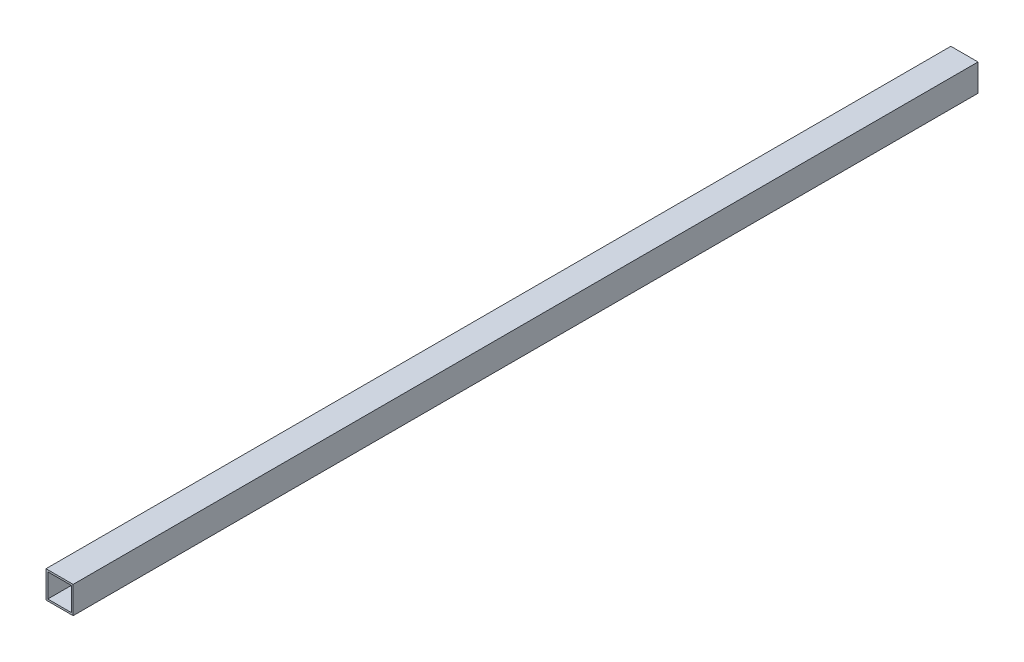
ISO-10303-21;
HEADER;
FILE_DESCRIPTION(('STEP AP214'),'2;1');
FILE_NAME('part.step','',(''),(''),'','','');
FILE_SCHEMA(('AUTOMOTIVE_DESIGN { 1 0 10303 214 1 1 1 1 }'));
ENDSEC;
DATA;
#1=APPLICATION_CONTEXT('core data for automotive mechanical design processes');
#2=APPLICATION_PROTOCOL_DEFINITION('international standard','automotive_design',2000,#1);
#3=PRODUCT_CONTEXT('',#1,'mechanical');
#4=PRODUCT('Part','Part','',(#3));
#5=PRODUCT_RELATED_PRODUCT_CATEGORY('part','',(#4));
#6=PRODUCT_DEFINITION_FORMATION('','',#4);
#7=PRODUCT_DEFINITION_CONTEXT('part definition',#1,'design');
#8=PRODUCT_DEFINITION('design','',#6,#7);
#9=PRODUCT_DEFINITION_SHAPE('','',#8);
#10=(LENGTH_UNIT() NAMED_UNIT(*) SI_UNIT(.MILLI.,.METRE.));
#11=(NAMED_UNIT(*) PLANE_ANGLE_UNIT() SI_UNIT($,.RADIAN.));
#12=(NAMED_UNIT(*) SI_UNIT($,.STERADIAN.) SOLID_ANGLE_UNIT());
#13=UNCERTAINTY_MEASURE_WITH_UNIT(LENGTH_MEASURE(1.E-05),#10,'distance_accuracy_value','');
#14=(GEOMETRIC_REPRESENTATION_CONTEXT(3) GLOBAL_UNCERTAINTY_ASSIGNED_CONTEXT((#13)) GLOBAL_UNIT_ASSIGNED_CONTEXT((#10,
#11,#12)) REPRESENTATION_CONTEXT('',''));
#15=CARTESIAN_POINT('',(0.,0.,0.));
#16=DIRECTION('',(0.,0.,1.));
#17=DIRECTION('',(1.,0.,0.));
#18=AXIS2_PLACEMENT_3D('',#15,#16,#17);
#19=CARTESIAN_POINT('',(-30.,30.,0.));
#20=DIRECTION('',(-1.,0.,0.));
#21=DIRECTION('',(0.,0.,1.));
#22=AXIS2_PLACEMENT_3D('',#19,#20,#21);
#23=PLANE('',#22);
#24=DIRECTION('',(0.,0.,1.));
#25=VECTOR('',#24,1.);
#26=CARTESIAN_POINT('',(-30.,-30.,0.));
#27=LINE('',#26,#25);
#28=CARTESIAN_POINT('',(-30.,-30.,0.));
#29=VERTEX_POINT('',#28);
#30=CARTESIAN_POINT('',(-30.,-30.,2000.));
#31=VERTEX_POINT('',#30);
#32=EDGE_CURVE('E90',#29,#31,#27,.T.);
#33=ORIENTED_EDGE('',*,*,#32,.T.);
#34=DIRECTION('',(0.,-1.,0.));
#35=VECTOR('',#34,1.);
#36=CARTESIAN_POINT('',(-30.,30.,2000.));
#37=LINE('',#36,#35);
#38=CARTESIAN_POINT('',(-30.,30.,2000.));
#39=VERTEX_POINT('',#38);
#40=EDGE_CURVE('E112',#39,#31,#37,.T.);
#41=ORIENTED_EDGE('',*,*,#40,.F.);
#42=DIRECTION('',(0.,0.,1.));
#43=VECTOR('',#42,1.);
#44=CARTESIAN_POINT('',(-30.,30.,0.));
#45=LINE('',#44,#43);
#46=CARTESIAN_POINT('',(-30.,30.,0.));
#47=VERTEX_POINT('',#46);
#48=EDGE_CURVE('E93',#47,#39,#45,.T.);
#49=ORIENTED_EDGE('',*,*,#48,.F.);
#50=DIRECTION('',(0.,-1.,0.));
#51=VECTOR('',#50,1.);
#52=CARTESIAN_POINT('',(-30.,30.,0.));
#53=LINE('',#52,#51);
#54=EDGE_CURVE('E89',#47,#29,#53,.T.);
#55=ORIENTED_EDGE('',*,*,#54,.T.);
#56=EDGE_LOOP('',(#33,#41,#49,#55));
#57=FACE_BOUND('',#56,.T.);
#58=ADVANCED_FACE('F33',(#57),#23,.T.);
#59=CARTESIAN_POINT('',(-30.,-30.,0.));
#60=DIRECTION('',(0.,-1.,0.));
#61=DIRECTION('',(0.,0.,-1.));
#62=AXIS2_PLACEMENT_3D('',#59,#60,#61);
#63=PLANE('',#62);
#64=DIRECTION('',(0.,0.,1.));
#65=VECTOR('',#64,1.);
#66=CARTESIAN_POINT('',(30.,-30.,0.));
#67=LINE('',#66,#65);
#68=CARTESIAN_POINT('',(30.,-30.,0.));
#69=VERTEX_POINT('',#68);
#70=CARTESIAN_POINT('',(30.,-30.,2000.));
#71=VERTEX_POINT('',#70);
#72=EDGE_CURVE('E100',#69,#71,#67,.T.);
#73=ORIENTED_EDGE('',*,*,#72,.T.);
#74=DIRECTION('',(1.,0.,0.));
#75=VECTOR('',#74,1.);
#76=CARTESIAN_POINT('',(-30.,-30.,2000.));
#77=LINE('',#76,#75);
#78=EDGE_CURVE('E99',#31,#71,#77,.T.);
#79=ORIENTED_EDGE('',*,*,#78,.F.);
#80=ORIENTED_EDGE('',*,*,#32,.F.);
#81=DIRECTION('',(1.,0.,0.));
#82=VECTOR('',#81,1.);
#83=CARTESIAN_POINT('',(-30.,-30.,0.));
#84=LINE('',#83,#82);
#85=EDGE_CURVE('E82',#29,#69,#84,.T.);
#86=ORIENTED_EDGE('',*,*,#85,.T.);
#87=EDGE_LOOP('',(#73,#79,#80,#86));
#88=FACE_BOUND('',#87,.T.);
#89=ADVANCED_FACE('F97',(#88),#63,.T.);
#90=CARTESIAN_POINT('',(30.,30.,0.));
#91=DIRECTION('',(1.,0.,0.));
#92=DIRECTION('',(0.,0.,-1.));
#93=AXIS2_PLACEMENT_3D('',#90,#91,#92);
#94=PLANE('',#93);
#95=DIRECTION('',(0.,0.,1.));
#96=VECTOR('',#95,1.);
#97=CARTESIAN_POINT('',(30.,30.,0.));
#98=LINE('',#97,#96);
#99=CARTESIAN_POINT('',(30.,30.,0.));
#100=VERTEX_POINT('',#99);
#101=CARTESIAN_POINT('',(30.,30.,2000.));
#102=VERTEX_POINT('',#101);
#103=EDGE_CURVE('E37',#100,#102,#98,.T.);
#104=ORIENTED_EDGE('',*,*,#103,.T.);
#105=DIRECTION('',(0.,1.,0.));
#106=VECTOR('',#105,1.);
#107=CARTESIAN_POINT('',(30.,30.,2000.));
#108=LINE('',#107,#106);
#109=EDGE_CURVE('E109',#71,#102,#108,.T.);
#110=ORIENTED_EDGE('',*,*,#109,.F.);
#111=ORIENTED_EDGE('',*,*,#72,.F.);
#112=DIRECTION('',(0.,1.,0.));
#113=VECTOR('',#112,1.);
#114=CARTESIAN_POINT('',(30.,30.,0.));
#115=LINE('',#114,#113);
#116=EDGE_CURVE('E104',#69,#100,#115,.T.);
#117=ORIENTED_EDGE('',*,*,#116,.T.);
#118=EDGE_LOOP('',(#104,#110,#111,#117));
#119=FACE_BOUND('',#118,.T.);
#120=ADVANCED_FACE('F118',(#119),#94,.T.);
#121=CARTESIAN_POINT('',(-30.,30.,0.));
#122=DIRECTION('',(0.,1.,0.));
#123=DIRECTION('',(0.,0.,1.));
#124=AXIS2_PLACEMENT_3D('',#121,#122,#123);
#125=PLANE('',#124);
#126=DIRECTION('',(-1.,0.,0.));
#127=VECTOR('',#126,1.);
#128=CARTESIAN_POINT('',(-30.,30.,2000.));
#129=LINE('',#128,#127);
#130=EDGE_CURVE('E123',#102,#39,#129,.T.);
#131=ORIENTED_EDGE('',*,*,#130,.F.);
#132=ORIENTED_EDGE('',*,*,#103,.F.);
#133=DIRECTION('',(-1.,0.,0.));
#134=VECTOR('',#133,1.);
#135=CARTESIAN_POINT('',(-30.,30.,0.));
#136=LINE('',#135,#134);
#137=EDGE_CURVE('E106',#100,#47,#136,.T.);
#138=ORIENTED_EDGE('',*,*,#137,.T.);
#139=ORIENTED_EDGE('',*,*,#48,.T.);
#140=EDGE_LOOP('',(#131,#132,#138,#139));
#141=FACE_BOUND('',#140,.T.);
#142=ADVANCED_FACE('F35',(#141),#125,.T.);
#143=CARTESIAN_POINT('',(0.,0.,0.));
#144=DIRECTION('',(0.,0.,1.));
#145=DIRECTION('',(1.,0.,0.));
#146=AXIS2_PLACEMENT_3D('',#143,#144,#145);
#147=PLANE('',#146);
#148=DIRECTION('',(0.,-1.,0.));
#149=VECTOR('',#148,1.);
#150=CARTESIAN_POINT('',(-26.,26.,0.));
#151=LINE('',#150,#149);
#152=CARTESIAN_POINT('',(-26.,-26.,0.));
#153=VERTEX_POINT('',#152);
#154=CARTESIAN_POINT('',(-26.,26.,0.));
#155=VERTEX_POINT('',#154);
#156=EDGE_CURVE('E128',#153,#155,#151,.F.);
#157=ORIENTED_EDGE('',*,*,#156,.F.);
#158=DIRECTION('',(1.,0.,0.));
#159=VECTOR('',#158,1.);
#160=CARTESIAN_POINT('',(-26.,-26.,0.));
#161=LINE('',#160,#159);
#162=CARTESIAN_POINT('',(26.,-26.,0.));
#163=VERTEX_POINT('',#162);
#164=EDGE_CURVE('E132',#163,#153,#161,.F.);
#165=ORIENTED_EDGE('',*,*,#164,.F.);
#166=DIRECTION('',(0.,1.,0.));
#167=VECTOR('',#166,1.);
#168=CARTESIAN_POINT('',(26.,26.,0.));
#169=LINE('',#168,#167);
#170=CARTESIAN_POINT('',(26.,26.,0.));
#171=VERTEX_POINT('',#170);
#172=EDGE_CURVE('E139',#171,#163,#169,.F.);
#173=ORIENTED_EDGE('',*,*,#172,.F.);
#174=DIRECTION('',(-1.,0.,0.));
#175=VECTOR('',#174,1.);
#176=CARTESIAN_POINT('',(-26.,26.,0.));
#177=LINE('',#176,#175);
#178=EDGE_CURVE('E124',#155,#171,#177,.F.);
#179=ORIENTED_EDGE('',*,*,#178,.F.);
#180=EDGE_LOOP('',(#157,#165,#173,#179));
#181=FACE_BOUND('',#180,.T.);
#182=ORIENTED_EDGE('',*,*,#54,.F.);
#183=ORIENTED_EDGE('',*,*,#137,.F.);
#184=ORIENTED_EDGE('',*,*,#116,.F.);
#185=ORIENTED_EDGE('',*,*,#85,.F.);
#186=EDGE_LOOP('',(#182,#183,#184,#185));
#187=FACE_BOUND('',#186,.T.);
#188=ADVANCED_FACE('F103',(#181,#187),#147,.F.);
#189=CARTESIAN_POINT('',(0.,0.,2000.));
#190=DIRECTION('',(0.,0.,1.));
#191=DIRECTION('',(1.,0.,0.));
#192=AXIS2_PLACEMENT_3D('',#189,#190,#191);
#193=PLANE('',#192);
#194=DIRECTION('',(0.,-1.,0.));
#195=VECTOR('',#194,1.);
#196=CARTESIAN_POINT('',(-26.,26.,2000.));
#197=LINE('',#196,#195);
#198=CARTESIAN_POINT('',(-26.,-26.,2000.));
#199=VERTEX_POINT('',#198);
#200=CARTESIAN_POINT('',(-26.,26.,2000.));
#201=VERTEX_POINT('',#200);
#202=EDGE_CURVE('E11',#199,#201,#197,.F.);
#203=ORIENTED_EDGE('',*,*,#202,.T.);
#204=DIRECTION('',(-1.,0.,0.));
#205=VECTOR('',#204,1.);
#206=CARTESIAN_POINT('',(-26.,26.,2000.));
#207=LINE('',#206,#205);
#208=CARTESIAN_POINT('',(26.,26.,2000.));
#209=VERTEX_POINT('',#208);
#210=EDGE_CURVE('E149',#201,#209,#207,.F.);
#211=ORIENTED_EDGE('',*,*,#210,.T.);
#212=DIRECTION('',(0.,1.,0.));
#213=VECTOR('',#212,1.);
#214=CARTESIAN_POINT('',(26.,26.,2000.));
#215=LINE('',#214,#213);
#216=CARTESIAN_POINT('',(26.,-26.,2000.));
#217=VERTEX_POINT('',#216);
#218=EDGE_CURVE('E142',#209,#217,#215,.F.);
#219=ORIENTED_EDGE('',*,*,#218,.T.);
#220=DIRECTION('',(1.,0.,0.));
#221=VECTOR('',#220,1.);
#222=CARTESIAN_POINT('',(-26.,-26.,2000.));
#223=LINE('',#222,#221);
#224=EDGE_CURVE('E51',#217,#199,#223,.F.);
#225=ORIENTED_EDGE('',*,*,#224,.T.);
#226=EDGE_LOOP('',(#203,#211,#219,#225));
#227=FACE_BOUND('',#226,.T.);
#228=ORIENTED_EDGE('',*,*,#40,.T.);
#229=ORIENTED_EDGE('',*,*,#78,.T.);
#230=ORIENTED_EDGE('',*,*,#109,.T.);
#231=ORIENTED_EDGE('',*,*,#130,.T.);
#232=EDGE_LOOP('',(#228,#229,#230,#231));
#233=FACE_BOUND('',#232,.T.);
#234=ADVANCED_FACE('F122',(#227,#233),#193,.T.);
#235=CARTESIAN_POINT('',(-26.,26.,0.));
#236=DIRECTION('',(0.,-1.,0.));
#237=DIRECTION('',(0.,0.,-1.));
#238=AXIS2_PLACEMENT_3D('',#235,#236,#237);
#239=PLANE('',#238);
#240=DIRECTION('',(0.,0.,1.));
#241=VECTOR('',#240,1.);
#242=CARTESIAN_POINT('',(26.,26.,0.));
#243=LINE('',#242,#241);
#244=EDGE_CURVE('E144',#171,#209,#243,.T.);
#245=ORIENTED_EDGE('',*,*,#244,.T.);
#246=ORIENTED_EDGE('',*,*,#210,.F.);
#247=DIRECTION('',(0.,0.,1.));
#248=VECTOR('',#247,1.);
#249=CARTESIAN_POINT('',(-26.,26.,0.));
#250=LINE('',#249,#248);
#251=EDGE_CURVE('E131',#155,#201,#250,.T.);
#252=ORIENTED_EDGE('',*,*,#251,.F.);
#253=ORIENTED_EDGE('',*,*,#178,.T.);
#254=EDGE_LOOP('',(#245,#246,#252,#253));
#255=FACE_BOUND('',#254,.T.);
#256=ADVANCED_FACE('F160',(#255),#239,.T.);
#257=CARTESIAN_POINT('',(26.,26.,0.));
#258=DIRECTION('',(-1.,0.,0.));
#259=DIRECTION('',(0.,0.,1.));
#260=AXIS2_PLACEMENT_3D('',#257,#258,#259);
#261=PLANE('',#260);
#262=DIRECTION('',(0.,0.,1.));
#263=VECTOR('',#262,1.);
#264=CARTESIAN_POINT('',(26.,-26.,0.));
#265=LINE('',#264,#263);
#266=EDGE_CURVE('E136',#163,#217,#265,.T.);
#267=ORIENTED_EDGE('',*,*,#266,.T.);
#268=ORIENTED_EDGE('',*,*,#218,.F.);
#269=ORIENTED_EDGE('',*,*,#244,.F.);
#270=ORIENTED_EDGE('',*,*,#172,.T.);
#271=EDGE_LOOP('',(#267,#268,#269,#270));
#272=FACE_BOUND('',#271,.T.);
#273=ADVANCED_FACE('F169',(#272),#261,.T.);
#274=CARTESIAN_POINT('',(-26.,-26.,0.));
#275=DIRECTION('',(0.,1.,0.));
#276=DIRECTION('',(0.,0.,1.));
#277=AXIS2_PLACEMENT_3D('',#274,#275,#276);
#278=PLANE('',#277);
#279=DIRECTION('',(0.,0.,1.));
#280=VECTOR('',#279,1.);
#281=CARTESIAN_POINT('',(-26.,-26.,0.));
#282=LINE('',#281,#280);
#283=EDGE_CURVE('E43',#153,#199,#282,.T.);
#284=ORIENTED_EDGE('',*,*,#283,.T.);
#285=ORIENTED_EDGE('',*,*,#224,.F.);
#286=ORIENTED_EDGE('',*,*,#266,.F.);
#287=ORIENTED_EDGE('',*,*,#164,.T.);
#288=EDGE_LOOP('',(#284,#285,#286,#287));
#289=FACE_BOUND('',#288,.T.);
#290=ADVANCED_FACE('F174',(#289),#278,.T.);
#291=CARTESIAN_POINT('',(-26.,26.,0.));
#292=DIRECTION('',(1.,0.,0.));
#293=DIRECTION('',(0.,0.,-1.));
#294=AXIS2_PLACEMENT_3D('',#291,#292,#293);
#295=PLANE('',#294);
#296=ORIENTED_EDGE('',*,*,#202,.F.);
#297=ORIENTED_EDGE('',*,*,#283,.F.);
#298=ORIENTED_EDGE('',*,*,#156,.T.);
#299=ORIENTED_EDGE('',*,*,#251,.T.);
#300=EDGE_LOOP('',(#296,#297,#298,#299));
#301=FACE_BOUND('',#300,.T.);
#302=ADVANCED_FACE('F178',(#301),#295,.T.);
#303=CLOSED_SHELL('',(#58,#89,#120,#142,#188,#234,#256,#273,#290,#302));
#304=MANIFOLD_SOLID_BREP('B2',#303);
#305=ADVANCED_BREP_SHAPE_REPRESENTATION('',(#18,#304),#14);
#306=SHAPE_DEFINITION_REPRESENTATION(#9,#305);
ENDSEC;
END-ISO-10303-21;
